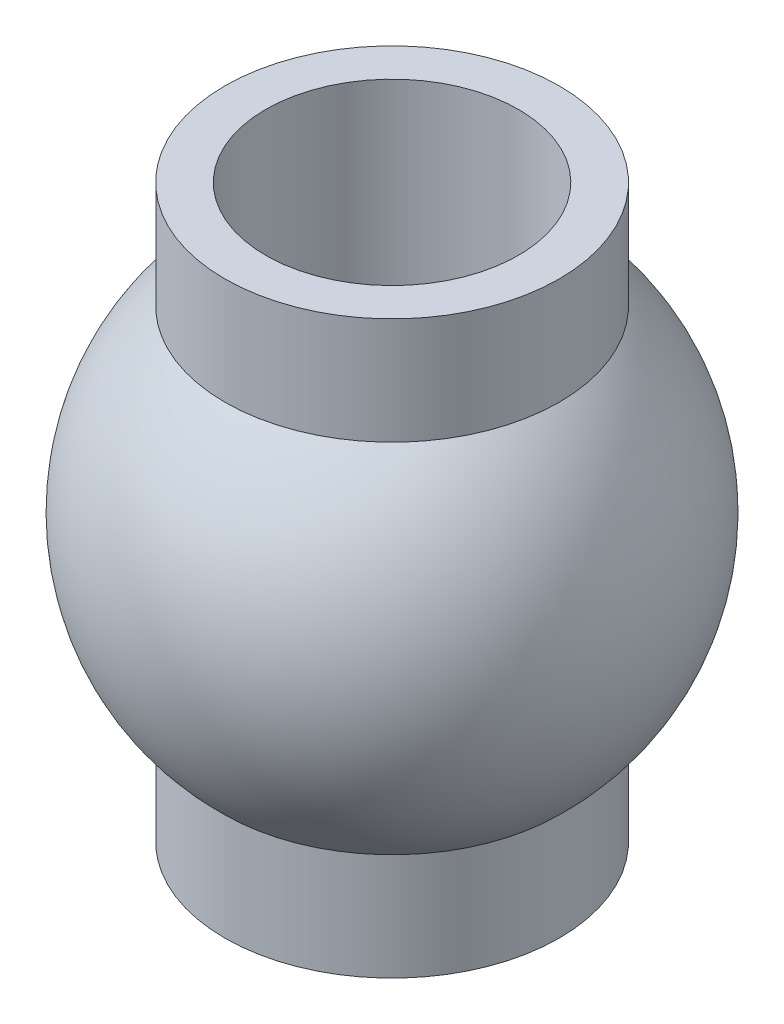
ISO-10303-21;
HEADER;
FILE_DESCRIPTION(('STEP AP214'),'2;1');
FILE_NAME('part.step','',(''),(''),'','','');
FILE_SCHEMA(('AUTOMOTIVE_DESIGN { 1 0 10303 214 1 1 1 1 }'));
ENDSEC;
DATA;
#1=APPLICATION_CONTEXT('core data for automotive mechanical design processes');
#2=APPLICATION_PROTOCOL_DEFINITION('international standard','automotive_design',2000,#1);
#3=PRODUCT_CONTEXT('',#1,'mechanical');
#4=PRODUCT('Part','Part','',(#3));
#5=PRODUCT_RELATED_PRODUCT_CATEGORY('part','',(#4));
#6=PRODUCT_DEFINITION_FORMATION('','',#4);
#7=PRODUCT_DEFINITION_CONTEXT('part definition',#1,'design');
#8=PRODUCT_DEFINITION('design','',#6,#7);
#9=PRODUCT_DEFINITION_SHAPE('','',#8);
#10=(LENGTH_UNIT() NAMED_UNIT(*) SI_UNIT(.MILLI.,.METRE.));
#11=(NAMED_UNIT(*) PLANE_ANGLE_UNIT() SI_UNIT($,.RADIAN.));
#12=(NAMED_UNIT(*) SI_UNIT($,.STERADIAN.) SOLID_ANGLE_UNIT());
#13=UNCERTAINTY_MEASURE_WITH_UNIT(LENGTH_MEASURE(1.E-05),#10,'distance_accuracy_value','');
#14=(GEOMETRIC_REPRESENTATION_CONTEXT(3) GLOBAL_UNCERTAINTY_ASSIGNED_CONTEXT((#13)) GLOBAL_UNIT_ASSIGNED_CONTEXT((#10,
#11,#12)) REPRESENTATION_CONTEXT('',''));
#15=CARTESIAN_POINT('',(0.,0.,0.));
#16=DIRECTION('',(0.,0.,1.));
#17=DIRECTION('',(1.,0.,0.));
#18=AXIS2_PLACEMENT_3D('',#15,#16,#17);
#19=CARTESIAN_POINT('',(0.,3.5,0.));
#20=DIRECTION('',(0.,1.,0.));
#21=DIRECTION('',(-1.,0.,0.));
#22=AXIS2_PLACEMENT_3D('',#19,#20,#21);
#23=CYLINDRICAL_SURFACE('',#22,2.05);
#24=CARTESIAN_POINT('',(0.,3.5,0.));
#25=DIRECTION('',(0.,1.,0.));
#26=DIRECTION('',(-1.,0.,0.));
#27=AXIS2_PLACEMENT_3D('',#24,#25,#26);
#28=CIRCLE('',#27,2.05);
#29=CARTESIAN_POINT('',(-2.05,3.5,0.));
#30=VERTEX_POINT('',#29);
#31=EDGE_CURVE('E10',#30,#30,#28,.T.);
#32=ORIENTED_EDGE('',*,*,#31,.F.);
#33=EDGE_LOOP('',(#32));
#34=FACE_BOUND('',#33,.T.);
#35=CARTESIAN_POINT('',(0.,2.19031961138095,0.));
#36=DIRECTION('',(0.,1.,0.));
#37=DIRECTION('',(-1.,0.,0.));
#38=AXIS2_PLACEMENT_3D('',#35,#36,#37);
#39=CIRCLE('',#38,2.05);
#40=CARTESIAN_POINT('',(-2.05,2.19031961138095,0.));
#41=VERTEX_POINT('',#40);
#42=EDGE_CURVE('E56',#41,#41,#39,.T.);
#43=ORIENTED_EDGE('',*,*,#42,.T.);
#44=EDGE_LOOP('',(#43));
#45=FACE_BOUND('',#44,.T.);
#46=ADVANCED_FACE('F34',(#34,#45),#23,.T.);
#47=CARTESIAN_POINT('',(1.55,3.5,0.));
#48=DIRECTION('',(0.,-1.,0.));
#49=DIRECTION('',(1.,0.,0.));
#50=AXIS2_PLACEMENT_3D('',#47,#48,#49);
#51=PLANE('',#50);
#52=CARTESIAN_POINT('',(0.,3.5,0.));
#53=DIRECTION('',(0.,1.,0.));
#54=DIRECTION('',(-1.,0.,0.));
#55=AXIS2_PLACEMENT_3D('',#52,#53,#54);
#56=CIRCLE('',#55,1.55);
#57=CARTESIAN_POINT('',(-1.55,3.5,0.));
#58=VERTEX_POINT('',#57);
#59=EDGE_CURVE('E40',#58,#58,#56,.T.);
#60=ORIENTED_EDGE('',*,*,#59,.F.);
#61=EDGE_LOOP('',(#60));
#62=FACE_BOUND('',#61,.T.);
#63=ORIENTED_EDGE('',*,*,#31,.T.);
#64=EDGE_LOOP('',(#63));
#65=FACE_BOUND('',#64,.T.);
#66=ADVANCED_FACE('F81',(#62,#65),#51,.F.);
#67=CARTESIAN_POINT('',(0.,3.5,0.));
#68=DIRECTION('',(0.,1.,0.));
#69=DIRECTION('',(-1.,0.,0.));
#70=AXIS2_PLACEMENT_3D('',#67,#68,#69);
#71=CYLINDRICAL_SURFACE('',#70,1.55);
#72=CARTESIAN_POINT('',(0.,-3.5,0.));
#73=DIRECTION('',(0.,1.,0.));
#74=DIRECTION('',(-1.,0.,0.));
#75=AXIS2_PLACEMENT_3D('',#72,#73,#74);
#76=CIRCLE('',#75,1.55);
#77=CARTESIAN_POINT('',(-1.55,-3.5,0.));
#78=VERTEX_POINT('',#77);
#79=EDGE_CURVE('E44',#78,#78,#76,.T.);
#80=ORIENTED_EDGE('',*,*,#79,.F.);
#81=EDGE_LOOP('',(#80));
#82=FACE_BOUND('',#81,.T.);
#83=ORIENTED_EDGE('',*,*,#59,.T.);
#84=EDGE_LOOP('',(#83));
#85=FACE_BOUND('',#84,.T.);
#86=ADVANCED_FACE('F76',(#82,#85),#71,.F.);
#87=CARTESIAN_POINT('',(1.55,-3.5,0.));
#88=DIRECTION('',(0.,1.,0.));
#89=DIRECTION('',(-1.,0.,0.));
#90=AXIS2_PLACEMENT_3D('',#87,#88,#89);
#91=PLANE('',#90);
#92=CARTESIAN_POINT('',(0.,-3.5,0.));
#93=DIRECTION('',(0.,1.,0.));
#94=DIRECTION('',(-1.,0.,0.));
#95=AXIS2_PLACEMENT_3D('',#92,#93,#94);
#96=CIRCLE('',#95,2.05);
#97=CARTESIAN_POINT('',(-2.05,-3.5,0.));
#98=VERTEX_POINT('',#97);
#99=EDGE_CURVE('E48',#98,#98,#96,.T.);
#100=ORIENTED_EDGE('',*,*,#99,.F.);
#101=EDGE_LOOP('',(#100));
#102=FACE_BOUND('',#101,.T.);
#103=ORIENTED_EDGE('',*,*,#79,.T.);
#104=EDGE_LOOP('',(#103));
#105=FACE_BOUND('',#104,.T.);
#106=ADVANCED_FACE('F70',(#102,#105),#91,.F.);
#107=CARTESIAN_POINT('',(0.,3.5,0.));
#108=DIRECTION('',(0.,1.,0.));
#109=DIRECTION('',(-1.,0.,0.));
#110=AXIS2_PLACEMENT_3D('',#107,#108,#109);
#111=CYLINDRICAL_SURFACE('',#110,2.05);
#112=CARTESIAN_POINT('',(0.,-2.19031961138095,0.));
#113=DIRECTION('',(0.,1.,0.));
#114=DIRECTION('',(-1.,0.,0.));
#115=AXIS2_PLACEMENT_3D('',#112,#113,#114);
#116=CIRCLE('',#115,2.05);
#117=CARTESIAN_POINT('',(-2.05,-2.19031961138095,0.));
#118=VERTEX_POINT('',#117);
#119=EDGE_CURVE('E53',#118,#118,#116,.T.);
#120=ORIENTED_EDGE('',*,*,#119,.F.);
#121=EDGE_LOOP('',(#120));
#122=FACE_BOUND('',#121,.T.);
#123=ORIENTED_EDGE('',*,*,#99,.T.);
#124=EDGE_LOOP('',(#123));
#125=FACE_BOUND('',#124,.T.);
#126=ADVANCED_FACE('F64',(#122,#125),#111,.T.);
#127=CARTESIAN_POINT('',(0.,0.,0.));
#128=DIRECTION('',(0.,1.,0.));
#129=DIRECTION('',(1.,0.,0.));
#130=AXIS2_PLACEMENT_3D('',#127,#128,#129);
#131=SPHERICAL_SURFACE('',#130,3.);
#132=ORIENTED_EDGE('',*,*,#42,.F.);
#133=EDGE_LOOP('',(#132));
#134=FACE_BOUND('',#133,.T.);
#135=ORIENTED_EDGE('',*,*,#119,.T.);
#136=EDGE_LOOP('',(#135));
#137=FACE_BOUND('',#136,.T.);
#138=ADVANCED_FACE('F61',(#134,#137),#131,.T.);
#139=CLOSED_SHELL('',(#46,#66,#86,#106,#126,#138));
#140=MANIFOLD_SOLID_BREP('B2',#139);
#141=ADVANCED_BREP_SHAPE_REPRESENTATION('',(#18,#140),#14);
#142=SHAPE_DEFINITION_REPRESENTATION(#9,#141);
ENDSEC;
END-ISO-10303-21;
